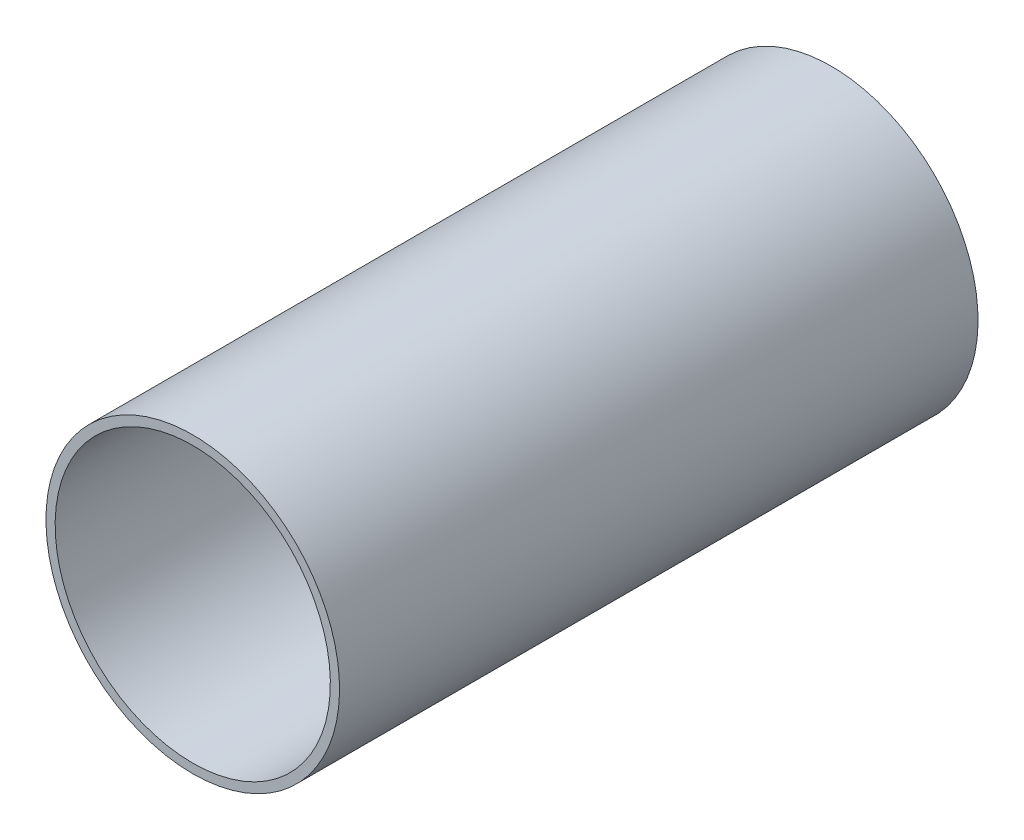
ISO-10303-21;
HEADER;
FILE_DESCRIPTION(('STEP AP214'),'2;1');
FILE_NAME('part.step','',(''),(''),'','','');
FILE_SCHEMA(('AUTOMOTIVE_DESIGN { 1 0 10303 214 1 1 1 1 }'));
ENDSEC;
DATA;
#1=APPLICATION_CONTEXT('core data for automotive mechanical design processes');
#2=APPLICATION_PROTOCOL_DEFINITION('international standard','automotive_design',2000,#1);
#3=PRODUCT_CONTEXT('',#1,'mechanical');
#4=PRODUCT('Part','Part','',(#3));
#5=PRODUCT_RELATED_PRODUCT_CATEGORY('part','',(#4));
#6=PRODUCT_DEFINITION_FORMATION('','',#4);
#7=PRODUCT_DEFINITION_CONTEXT('part definition',#1,'design');
#8=PRODUCT_DEFINITION('design','',#6,#7);
#9=PRODUCT_DEFINITION_SHAPE('','',#8);
#10=(LENGTH_UNIT() NAMED_UNIT(*) SI_UNIT(.MILLI.,.METRE.));
#11=(NAMED_UNIT(*) PLANE_ANGLE_UNIT() SI_UNIT($,.RADIAN.));
#12=(NAMED_UNIT(*) SI_UNIT($,.STERADIAN.) SOLID_ANGLE_UNIT());
#13=UNCERTAINTY_MEASURE_WITH_UNIT(LENGTH_MEASURE(1.E-05),#10,'distance_accuracy_value','');
#14=(GEOMETRIC_REPRESENTATION_CONTEXT(3) GLOBAL_UNCERTAINTY_ASSIGNED_CONTEXT((#13)) GLOBAL_UNIT_ASSIGNED_CONTEXT((#10,
#11,#12)) REPRESENTATION_CONTEXT('',''));
#15=CARTESIAN_POINT('',(0.,0.,0.));
#16=DIRECTION('',(0.,0.,1.));
#17=DIRECTION('',(1.,0.,0.));
#18=AXIS2_PLACEMENT_3D('',#15,#16,#17);
#19=CARTESIAN_POINT('',(148.844,-73.152,-0.045));
#20=DIRECTION('',(0.,0.,-1.));
#21=DIRECTION('',(0.,-1.,0.));
#22=AXIS2_PLACEMENT_3D('',#19,#20,#21);
#23=CYLINDRICAL_SURFACE('',#22,0.375);
#24=CARTESIAN_POINT('',(148.844,-73.152,-0.035));
#25=DIRECTION('',(0.,0.,-1.));
#26=DIRECTION('',(0.,-1.,0.));
#27=AXIS2_PLACEMENT_3D('',#24,#25,#26);
#28=CIRCLE('',#27,0.375);
#29=CARTESIAN_POINT('',(148.844,-73.527,-0.035));
#30=VERTEX_POINT('',#29);
#31=EDGE_CURVE('E64',#30,#30,#28,.T.);
#32=ORIENTED_EDGE('',*,*,#31,.T.);
#33=DIRECTION('',(0.,0.,1.));
#34=VECTOR('',#33,1.);
#35=CARTESIAN_POINT('',(148.844,-73.527,-0.045));
#36=LINE('',#35,#34);
#37=CARTESIAN_POINT('',(148.844,-73.527,1.705));
#38=VERTEX_POINT('',#37);
#39=EDGE_CURVE('E11',#30,#38,#36,.T.);
#40=ORIENTED_EDGE('',*,*,#39,.T.);
#41=CARTESIAN_POINT('',(148.844,-73.152,1.705));
#42=DIRECTION('',(0.,0.,-1.));
#43=DIRECTION('',(0.,-1.,0.));
#44=AXIS2_PLACEMENT_3D('',#41,#42,#43);
#45=CIRCLE('',#44,0.375);
#46=EDGE_CURVE('E21',#38,#38,#45,.T.);
#47=ORIENTED_EDGE('',*,*,#46,.F.);
#48=ORIENTED_EDGE('',*,*,#39,.F.);
#49=EDGE_LOOP('',(#32,#40,#47,#48));
#50=FACE_BOUND('',#49,.T.);
#51=ADVANCED_FACE('F17',(#50),#23,.F.);
#52=CARTESIAN_POINT('',(148.844,-73.552,1.705));
#53=DIRECTION('',(0.,0.,1.));
#54=DIRECTION('',(1.,0.,0.));
#55=AXIS2_PLACEMENT_3D('',#52,#53,#54);
#56=PLANE('',#55);
#57=ORIENTED_EDGE('',*,*,#46,.T.);
#58=EDGE_LOOP('',(#57));
#59=FACE_BOUND('',#58,.T.);
#60=CARTESIAN_POINT('',(148.844,-73.152,1.705));
#61=DIRECTION('',(0.,0.,1.));
#62=DIRECTION('',(0.,-1.,0.));
#63=AXIS2_PLACEMENT_3D('',#60,#61,#62);
#64=CIRCLE('',#63,0.4);
#65=CARTESIAN_POINT('',(148.844,-73.552,1.705));
#66=VERTEX_POINT('',#65);
#67=EDGE_CURVE('E56',#66,#66,#64,.T.);
#68=ORIENTED_EDGE('',*,*,#67,.T.);
#69=EDGE_LOOP('',(#68));
#70=FACE_BOUND('',#69,.T.);
#71=ADVANCED_FACE('F19',(#59,#70),#56,.T.);
#72=CARTESIAN_POINT('',(148.844,-73.552,-0.035));
#73=DIRECTION('',(0.,0.,1.));
#74=DIRECTION('',(1.,0.,0.));
#75=AXIS2_PLACEMENT_3D('',#72,#73,#74);
#76=PLANE('',#75);
#77=ORIENTED_EDGE('',*,*,#31,.F.);
#78=EDGE_LOOP('',(#77));
#79=FACE_BOUND('',#78,.T.);
#80=CARTESIAN_POINT('',(148.844,-73.152,-0.035));
#81=DIRECTION('',(0.,0.,1.));
#82=DIRECTION('',(0.,-1.,0.));
#83=AXIS2_PLACEMENT_3D('',#80,#81,#82);
#84=CIRCLE('',#83,0.4);
#85=CARTESIAN_POINT('',(148.844,-73.552,-0.035));
#86=VERTEX_POINT('',#85);
#87=EDGE_CURVE('E55',#86,#86,#84,.T.);
#88=ORIENTED_EDGE('',*,*,#87,.F.);
#89=EDGE_LOOP('',(#88));
#90=FACE_BOUND('',#89,.T.);
#91=ADVANCED_FACE('F82',(#79,#90),#76,.F.);
#92=CARTESIAN_POINT('',(148.844,-73.152,-0.035));
#93=DIRECTION('',(0.,0.,-1.));
#94=DIRECTION('',(0.,-1.,0.));
#95=AXIS2_PLACEMENT_3D('',#92,#93,#94);
#96=CYLINDRICAL_SURFACE('',#95,0.4);
#97=ORIENTED_EDGE('',*,*,#87,.T.);
#98=DIRECTION('',(0.,0.,1.));
#99=VECTOR('',#98,1.);
#100=CARTESIAN_POINT('',(148.844,-73.552,-0.035));
#101=LINE('',#100,#99);
#102=EDGE_CURVE('E52',#86,#66,#101,.T.);
#103=ORIENTED_EDGE('',*,*,#102,.T.);
#104=ORIENTED_EDGE('',*,*,#67,.F.);
#105=ORIENTED_EDGE('',*,*,#102,.F.);
#106=EDGE_LOOP('',(#97,#103,#104,#105));
#107=FACE_BOUND('',#106,.T.);
#108=ADVANCED_FACE('F53',(#107),#96,.T.);
#109=CLOSED_SHELL('',(#51,#71,#91,#108));
#110=MANIFOLD_SOLID_BREP('B1',#109);
#111=ADVANCED_BREP_SHAPE_REPRESENTATION('',(#18,#110),#14);
#112=SHAPE_DEFINITION_REPRESENTATION(#9,#111);
ENDSEC;
END-ISO-10303-21;
